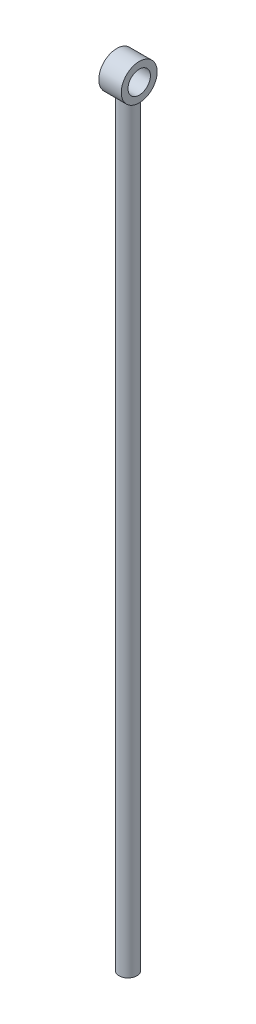
ISO-10303-21;
HEADER;
FILE_DESCRIPTION(('STEP AP214'),'2;1');
FILE_NAME('part.step','',(''),(''),'','','');
FILE_SCHEMA(('AUTOMOTIVE_DESIGN { 1 0 10303 214 1 1 1 1 }'));
ENDSEC;
DATA;
#1=APPLICATION_CONTEXT('core data for automotive mechanical design processes');
#2=APPLICATION_PROTOCOL_DEFINITION('international standard','automotive_design',2000,#1);
#3=PRODUCT_CONTEXT('',#1,'mechanical');
#4=PRODUCT('Part','Part','',(#3));
#5=PRODUCT_RELATED_PRODUCT_CATEGORY('part','',(#4));
#6=PRODUCT_DEFINITION_FORMATION('','',#4);
#7=PRODUCT_DEFINITION_CONTEXT('part definition',#1,'design');
#8=PRODUCT_DEFINITION('design','',#6,#7);
#9=PRODUCT_DEFINITION_SHAPE('','',#8);
#10=(LENGTH_UNIT() NAMED_UNIT(*) SI_UNIT(.MILLI.,.METRE.));
#11=(NAMED_UNIT(*) PLANE_ANGLE_UNIT() SI_UNIT($,.RADIAN.));
#12=(NAMED_UNIT(*) SI_UNIT($,.STERADIAN.) SOLID_ANGLE_UNIT());
#13=UNCERTAINTY_MEASURE_WITH_UNIT(LENGTH_MEASURE(1.E-05),#10,'distance_accuracy_value','');
#14=(GEOMETRIC_REPRESENTATION_CONTEXT(3) GLOBAL_UNCERTAINTY_ASSIGNED_CONTEXT((#13)) GLOBAL_UNIT_ASSIGNED_CONTEXT((#10,
#11,#12)) REPRESENTATION_CONTEXT('',''));
#15=CARTESIAN_POINT('',(0.,0.,0.));
#16=DIRECTION('',(0.,0.,1.));
#17=DIRECTION('',(1.,0.,0.));
#18=AXIS2_PLACEMENT_3D('',#15,#16,#17);
#19=CARTESIAN_POINT('',(3.175,0.,0.));
#20=DIRECTION('',(1.,0.,0.));
#21=DIRECTION('',(0.,0.,-1.));
#22=AXIS2_PLACEMENT_3D('',#19,#20,#21);
#23=PLANE('',#22);
#24=CARTESIAN_POINT('',(3.175,0.,0.));
#25=DIRECTION('',(1.,0.,0.));
#26=DIRECTION('',(0.,0.,-1.));
#27=AXIS2_PLACEMENT_3D('',#24,#25,#26);
#28=CIRCLE('',#27,5.08);
#29=CARTESIAN_POINT('',(3.175,0.,-5.08));
#30=VERTEX_POINT('',#29);
#31=EDGE_CURVE('E10',#30,#30,#28,.T.);
#32=ORIENTED_EDGE('',*,*,#31,.T.);
#33=EDGE_LOOP('',(#32));
#34=FACE_BOUND('',#33,.T.);
#35=CARTESIAN_POINT('',(3.175,0.,0.));
#36=DIRECTION('',(1.,0.,0.));
#37=DIRECTION('',(0.,0.,-1.));
#38=AXIS2_PLACEMENT_3D('',#35,#36,#37);
#39=CIRCLE('',#38,3.175);
#40=CARTESIAN_POINT('',(3.175,0.,-3.175));
#41=VERTEX_POINT('',#40);
#42=EDGE_CURVE('E47',#41,#41,#39,.T.);
#43=ORIENTED_EDGE('',*,*,#42,.F.);
#44=EDGE_LOOP('',(#43));
#45=FACE_BOUND('',#44,.T.);
#46=ADVANCED_FACE('F30',(#34,#45),#23,.T.);
#47=CARTESIAN_POINT('',(-3.175,0.,0.));
#48=DIRECTION('',(1.,0.,0.));
#49=DIRECTION('',(0.,0.,-1.));
#50=AXIS2_PLACEMENT_3D('',#47,#48,#49);
#51=PLANE('',#50);
#52=CARTESIAN_POINT('',(-3.175,0.,0.));
#53=DIRECTION('',(1.,0.,0.));
#54=DIRECTION('',(0.,0.,-1.));
#55=AXIS2_PLACEMENT_3D('',#52,#53,#54);
#56=CIRCLE('',#55,5.08);
#57=CARTESIAN_POINT('',(-3.175,0.,-5.08));
#58=VERTEX_POINT('',#57);
#59=EDGE_CURVE('E42',#58,#58,#56,.T.);
#60=ORIENTED_EDGE('',*,*,#59,.F.);
#61=EDGE_LOOP('',(#60));
#62=FACE_BOUND('',#61,.T.);
#63=CARTESIAN_POINT('',(-3.175,0.,0.));
#64=DIRECTION('',(1.,0.,0.));
#65=DIRECTION('',(0.,0.,-1.));
#66=AXIS2_PLACEMENT_3D('',#63,#64,#65);
#67=CIRCLE('',#66,3.175);
#68=CARTESIAN_POINT('',(-3.175,0.,-3.175));
#69=VERTEX_POINT('',#68);
#70=EDGE_CURVE('E49',#69,#69,#67,.T.);
#71=ORIENTED_EDGE('',*,*,#70,.T.);
#72=EDGE_LOOP('',(#71));
#73=FACE_BOUND('',#72,.T.);
#74=ADVANCED_FACE('F77',(#62,#73),#51,.F.);
#75=CARTESIAN_POINT('',(3.175,0.,0.));
#76=DIRECTION('',(-1.,0.,0.));
#77=DIRECTION('',(0.,0.,1.));
#78=AXIS2_PLACEMENT_3D('',#75,#76,#77);
#79=CYLINDRICAL_SURFACE('',#78,5.08);
#80=CARTESIAN_POINT('',(0.,-4.39940905122495,2.54));
#81=CARTESIAN_POINT('',(0.132350770986516,-4.39942205989359,2.53998931611415));
#82=CARTESIAN_POINT('',(0.264873964207068,-4.40547294637032,2.52958553785379));
#83=CARTESIAN_POINT('',(0.525850075073699,-4.42880371084738,2.48849734176543));
#84=CARTESIAN_POINT('',(0.654293844122206,-4.44610718321639,2.45777030791457));
#85=CARTESIAN_POINT('',(0.902847008690043,-4.48943350901605,2.37769376629531));
#86=CARTESIAN_POINT('',(1.0229967587392,-4.51540993120344,2.32844325135882));
#87=CARTESIAN_POINT('',(1.25329753210406,-4.57308365657239,2.21301954201317));
#88=CARTESIAN_POINT('',(1.36344801406452,-4.60478126921897,2.14684543210874));
#89=CARTESIAN_POINT('',(1.58065653277959,-4.67352048301249,1.99305300466329));
#90=CARTESIAN_POINT('',(1.6867101998416,-4.71078721880883,1.90411616957988));
#91=CARTESIAN_POINT('',(1.88317731132461,-4.78464836035092,1.71006467356716));
#92=CARTESIAN_POINT('',(1.97358295427903,-4.82124242264972,1.60494199210148));
#93=CARTESIAN_POINT('',(2.14215256250941,-4.89258551531369,1.37284349041707));
#94=CARTESIAN_POINT('',(2.21908056998761,-4.92704390321097,1.24487225991669));
#95=CARTESIAN_POINT('',(2.3498577676196,-4.98730920473876,0.975758847737885));
#96=CARTESIAN_POINT('',(2.40372152268551,-5.01312157601807,0.834625046916222));
#97=CARTESIAN_POINT('',(2.48286183961459,-5.05156371564911,0.553834157529898));
#98=CARTESIAN_POINT('',(2.50989979691897,-5.0650007976228,0.414786547830358));
#99=CARTESIAN_POINT('',(2.54042194145867,-5.08019262967796,0.133529396903767));
#100=CARTESIAN_POINT('',(2.54392038026728,-5.08195444832547,-0.00867817884021334));
#101=CARTESIAN_POINT('',(2.52794344810967,-5.07397974068068,-0.278974612038957));
#102=CARTESIAN_POINT('',(2.51043944057458,-5.06522979566164,-0.407215845909756));
#103=CARTESIAN_POINT('',(2.45648265648368,-5.03870582959682,-0.658656980671832));
#104=CARTESIAN_POINT('',(2.4200284620008,-5.0209311332862,-0.78185650357838));
#105=CARTESIAN_POINT('',(2.32897028213146,-4.97767821550663,-1.02186585458686));
#106=CARTESIAN_POINT('',(2.27412216454284,-4.95209681484171,-1.1385636957286));
#107=CARTESIAN_POINT('',(2.14817092284832,-4.8955362080618,-1.3613810758438));
#108=CARTESIAN_POINT('',(2.07706197921206,-4.86455507040008,-1.46749680805015));
#109=CARTESIAN_POINT('',(1.91288580710611,-4.79664761774044,-1.67684109868143));
#110=CARTESIAN_POINT('',(1.81837830805193,-4.75943615035365,-1.77884855057458));
#111=CARTESIAN_POINT('',(1.61394209867736,-4.68514025090501,-1.96622510055636));
#112=CARTESIAN_POINT('',(1.50400163442388,-4.64805593794697,-2.05158139739855));
#113=CARTESIAN_POINT('',(1.26327359124282,-4.57566156474911,-2.20854354999122));
#114=CARTESIAN_POINT('',(1.1316055014423,-4.54061372776397,-2.27893198004425));
#115=CARTESIAN_POINT('',(0.856138314748144,-4.47993643707583,-2.39603054702313));
#116=CARTESIAN_POINT('',(0.71235206013539,-4.45429716317011,-2.44276539185566));
#117=CARTESIAN_POINT('',(0.428715141341713,-4.41819374975267,-2.5074377360036));
#118=CARTESIAN_POINT('',(0.289455557629385,-4.40668805855181,-2.52736381018474));
#119=CARTESIAN_POINT('',(0.00914059254797551,-4.39719515178488,-2.54385304439302));
#120=CARTESIAN_POINT('',(-0.131913449964288,-4.39919838698852,-2.54043270758017));
#121=CARTESIAN_POINT('',(-0.395360953189945,-4.41539214813086,-2.51215155009367));
#122=CARTESIAN_POINT('',(-0.518107805814045,-4.42822552266901,-2.48967705444965));
#123=CARTESIAN_POINT('',(-0.757854177128324,-4.46262814740406,-2.42746856296641));
#124=CARTESIAN_POINT('',(-0.874851820896721,-4.48420022652786,-2.38772897770403));
#125=CARTESIAN_POINT('',(-1.1059447804925,-4.53482004082328,-2.29018487505636));
#126=CARTESIAN_POINT('',(-1.21965470280668,-4.5641677383738,-2.23162892177933));
#127=CARTESIAN_POINT('',(-1.43629194971038,-4.62676543523015,-2.09876914260033));
#128=CARTESIAN_POINT('',(-1.53921369452875,-4.66001743522078,-2.02445722700453));
#129=CARTESIAN_POINT('',(-1.74492606950417,-4.7317151607909,-1.8512464046843));
#130=CARTESIAN_POINT('',(-1.84606476280058,-4.77028721211879,-1.75042899167689));
#131=CARTESIAN_POINT('',(-2.03050708452601,-4.84464956843862,-1.53264741831478));
#132=CARTESIAN_POINT('',(-2.11380468846908,-4.88043893119639,-1.41567782563628));
#133=CARTESIAN_POINT('',(-2.26205726382754,-4.94643058694972,-1.16467982088723));
#134=CARTESIAN_POINT('',(-2.32647011993179,-4.97646049846733,-1.03028266779287));
#135=CARTESIAN_POINT('',(-2.43113027612141,-5.02623721596846,-0.750626806233689));
#136=CARTESIAN_POINT('',(-2.4713987956788,-5.04599304938814,-0.605377761705419));
#137=CARTESIAN_POINT('',(-2.52315615190612,-5.07155470781231,-0.322528392965501));
#138=CARTESIAN_POINT('',(-2.53694660080363,-5.07847416884123,-0.185449066830742));
#139=CARTESIAN_POINT('',(-2.54214189817451,-5.08107011155515,0.0892200037668297));
#140=CARTESIAN_POINT('',(-2.53355458303166,-5.07675052899874,0.226809552706649));
#141=CARTESIAN_POINT('',(-2.49576231311817,-5.05800280839007,0.48904650239381));
#142=CARTESIAN_POINT('',(-2.4679532336175,-5.04425952422996,0.61394929414292));
#143=CARTESIAN_POINT('',(-2.39438947104553,-5.00867917938799,0.857112711643085));
#144=CARTESIAN_POINT('',(-2.34863221445223,-4.98684095802806,0.975372382080608));
#145=CARTESIAN_POINT('',(-2.23843309616091,-4.93587863969352,1.20757547866786));
#146=CARTESIAN_POINT('',(-2.17327579091512,-4.90648287186912,1.32111796446808));
#147=CARTESIAN_POINT('',(-2.02702758409005,-4.84347858678505,1.53612748815071));
#148=CARTESIAN_POINT('',(-1.9459293642911,-4.8098681372077,1.63758894534284));
#149=CARTESIAN_POINT('',(-1.76073227283945,-4.7378266792774,1.83620199001559));
#150=CARTESIAN_POINT('',(-1.65514759038326,-4.699248814929,1.93191975666587));
#151=CARTESIAN_POINT('',(-1.42888687005165,-4.624402214575,2.10480311060383));
#152=CARTESIAN_POINT('',(-1.30819762317358,-4.58813554213154,2.18195228481965));
#153=CARTESIAN_POINT('',(-1.04989770445311,-4.52118966549109,2.31758127690365));
#154=CARTESIAN_POINT('',(-0.911872813360602,-4.49072325472536,2.37539406025089));
#155=CARTESIAN_POINT('',(-0.697765788087909,-4.45384197022655,2.44342830470546));
#156=CARTESIAN_POINT('',(-0.625287267891228,-4.44302374432391,2.46298296006935));
#157=CARTESIAN_POINT('',(-0.478494652001076,-4.4247569535767,2.49565248651881));
#158=CARTESIAN_POINT('',(-0.404181877990313,-4.41730603307902,2.50877186006043));
#159=CARTESIAN_POINT('',(-0.274826997668309,-4.40764960015607,2.52568624860646));
#160=CARTESIAN_POINT('',(-0.220049017343598,-4.40456814817188,2.5310476681887));
#161=CARTESIAN_POINT('',(-0.110190669828626,-4.40044509709904,2.53820688744636));
#162=CARTESIAN_POINT('',(-0.0551102826564787,-4.39940363447217,2.54000444872338));
#163=CARTESIAN_POINT('',(0.,-4.39940905122495,2.54));
#164=B_SPLINE_CURVE_WITH_KNOTS('',3,(#80,#81,#82,#83,#84,#85,#86,#87,#88,#89,#90,#91,#92,#93,
#94,#95,#96,#97,#98,#99,#100,#101,#102,#103,#104,#105,#106,#107,#108,#109,#110,#111,#112,#113,
#114,#115,#116,#117,#118,#119,#120,#121,#122,#123,#124,#125,#126,#127,#128,#129,#130,#131,#132,
#133,#134,#135,#136,#137,#138,#139,#140,#141,#142,#143,#144,#145,#146,#147,#148,#149,#150,#151,
#152,#153,#154,#155,#156,#157,#158,#159,#160,#161,#162,#163),.UNSPECIFIED.,.T.,.F.,(4,2,2,2,2,2,
2,2,2,2,2,2,2,2,2,2,2,2,2,2,2,2,2,2,2,2,2,2,2,2,2,2,2,2,2,2,2,2,2,2,2,4),(0.,0.396829591390577,
0.794493947775004,1.19006263366415,1.58565272268233,2.01387027379716,2.44230070559467,
2.89961046291624,3.35663100493448,3.7811325182372,4.20537700167706,4.59272887615892,
4.98010973799501,5.37285018222277,5.76573140354855,6.19575066305667,6.62609922549798,
7.08377657997964,7.54097486502895,7.96194218774863,8.38261196703632,8.75726425902189,
9.13203793192765,9.52416932876627,9.91650255004085,10.3582912869992,10.800228970498,
11.253830207941,11.7070322071944,12.1186516679446,12.5301270046185,12.9144883917876,
13.2989049112568,13.6997630683262,14.1008056846099,14.5417601430434,14.9831029483186,
15.4383930256322,15.6656272060413,15.8927021740858,16.0579292295491,16.2231673372305),.UNSPECIFIED.);
#165=CARTESIAN_POINT('',(0.,-4.39940905122495,2.54));
#166=VERTEX_POINT('',#165);
#167=EDGE_CURVE('E35',#166,#166,#164,.T.);
#168=ORIENTED_EDGE('',*,*,#167,.T.);
#169=EDGE_LOOP('',(#168));
#170=FACE_BOUND('',#169,.T.);
#171=ORIENTED_EDGE('',*,*,#31,.F.);
#172=EDGE_LOOP('',(#171));
#173=FACE_BOUND('',#172,.T.);
#174=ORIENTED_EDGE('',*,*,#59,.T.);
#175=EDGE_LOOP('',(#174));
#176=FACE_BOUND('',#175,.T.);
#177=ADVANCED_FACE('F32',(#170,#173,#176),#79,.T.);
#178=CARTESIAN_POINT('',(3.175,0.,0.));
#179=DIRECTION('',(-1.,0.,0.));
#180=DIRECTION('',(0.,0.,1.));
#181=AXIS2_PLACEMENT_3D('',#178,#179,#180);
#182=CYLINDRICAL_SURFACE('',#181,3.175);
#183=ORIENTED_EDGE('',*,*,#42,.T.);
#184=EDGE_LOOP('',(#183));
#185=FACE_BOUND('',#184,.T.);
#186=ORIENTED_EDGE('',*,*,#70,.F.);
#187=EDGE_LOOP('',(#186));
#188=FACE_BOUND('',#187,.T.);
#189=ADVANCED_FACE('F66',(#185,#188),#182,.F.);
#190=CARTESIAN_POINT('',(0.,-219.202,0.));
#191=DIRECTION('',(0.,1.,0.));
#192=DIRECTION('',(0.,0.,1.));
#193=AXIS2_PLACEMENT_3D('',#190,#191,#192);
#194=CYLINDRICAL_SURFACE('',#193,2.54);
#195=CARTESIAN_POINT('',(0.,-219.202,0.));
#196=DIRECTION('',(0.,1.,0.));
#197=DIRECTION('',(0.,0.,1.));
#198=AXIS2_PLACEMENT_3D('',#195,#196,#197);
#199=CIRCLE('',#198,2.54);
#200=CARTESIAN_POINT('',(0.,-219.202,2.54));
#201=VERTEX_POINT('',#200);
#202=EDGE_CURVE('E54',#201,#201,#199,.T.);
#203=ORIENTED_EDGE('',*,*,#202,.T.);
#204=EDGE_LOOP('',(#203));
#205=FACE_BOUND('',#204,.T.);
#206=ORIENTED_EDGE('',*,*,#167,.F.);
#207=EDGE_LOOP('',(#206));
#208=FACE_BOUND('',#207,.T.);
#209=ADVANCED_FACE('F63',(#205,#208),#194,.T.);
#210=CARTESIAN_POINT('',(0.,-219.202,0.));
#211=DIRECTION('',(0.,1.,0.));
#212=DIRECTION('',(0.,0.,1.));
#213=AXIS2_PLACEMENT_3D('',#210,#211,#212);
#214=PLANE('',#213);
#215=ORIENTED_EDGE('',*,*,#202,.F.);
#216=EDGE_LOOP('',(#215));
#217=FACE_BOUND('',#216,.T.);
#218=ADVANCED_FACE('F65',(#217),#214,.F.);
#219=CLOSED_SHELL('',(#46,#74,#177,#189,#209,#218));
#220=MANIFOLD_SOLID_BREP('B2',#219);
#221=ADVANCED_BREP_SHAPE_REPRESENTATION('',(#18,#220),#14);
#222=SHAPE_DEFINITION_REPRESENTATION(#9,#221);
ENDSEC;
END-ISO-10303-21;
